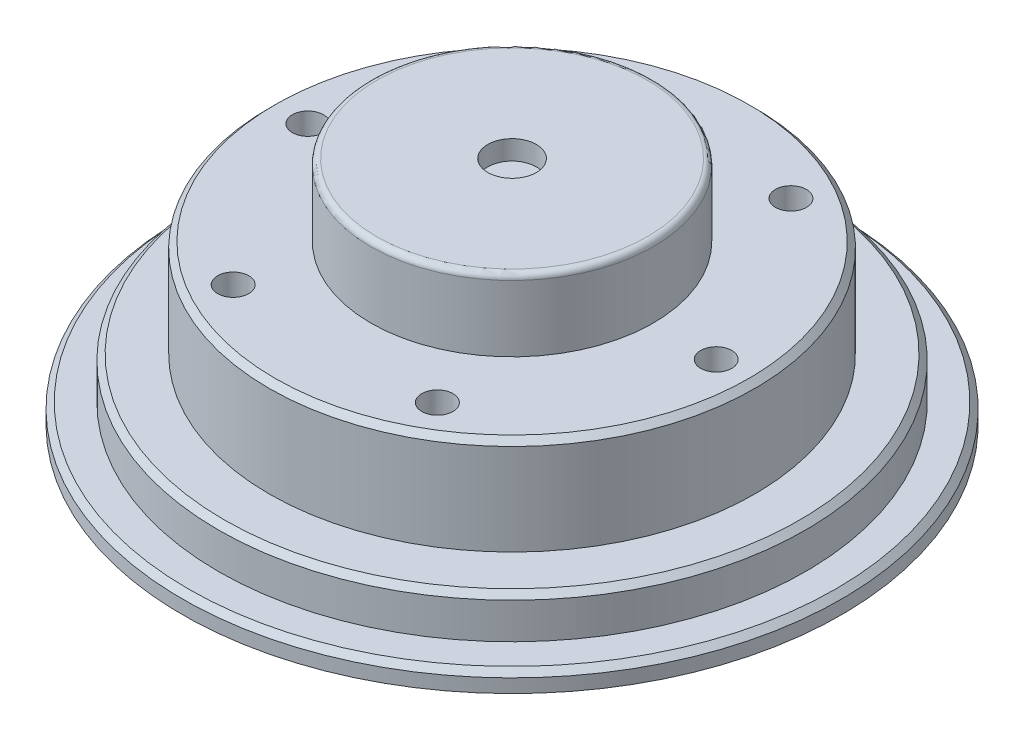
ISO-10303-21;
HEADER;
FILE_DESCRIPTION(('STEP AP214'),'2;1');
FILE_NAME('part.step','',(''),(''),'','','');
FILE_SCHEMA(('AUTOMOTIVE_DESIGN { 1 0 10303 214 1 1 1 1 }'));
ENDSEC;
DATA;
#1=APPLICATION_CONTEXT('core data for automotive mechanical design processes');
#2=APPLICATION_PROTOCOL_DEFINITION('international standard','automotive_design',2000,#1);
#3=PRODUCT_CONTEXT('',#1,'mechanical');
#4=PRODUCT('Part','Part','',(#3));
#5=PRODUCT_RELATED_PRODUCT_CATEGORY('part','',(#4));
#6=PRODUCT_DEFINITION_FORMATION('','',#4);
#7=PRODUCT_DEFINITION_CONTEXT('part definition',#1,'design');
#8=PRODUCT_DEFINITION('design','',#6,#7);
#9=PRODUCT_DEFINITION_SHAPE('','',#8);
#10=(LENGTH_UNIT() NAMED_UNIT(*) SI_UNIT(.MILLI.,.METRE.));
#11=(NAMED_UNIT(*) PLANE_ANGLE_UNIT() SI_UNIT($,.RADIAN.));
#12=(NAMED_UNIT(*) SI_UNIT($,.STERADIAN.) SOLID_ANGLE_UNIT());
#13=UNCERTAINTY_MEASURE_WITH_UNIT(LENGTH_MEASURE(1.E-05),#10,'distance_accuracy_value','');
#14=(GEOMETRIC_REPRESENTATION_CONTEXT(3) GLOBAL_UNCERTAINTY_ASSIGNED_CONTEXT((#13)) GLOBAL_UNIT_ASSIGNED_CONTEXT((#10,
#11,#12)) REPRESENTATION_CONTEXT('',''));
#15=CARTESIAN_POINT('',(0.,0.,0.));
#16=DIRECTION('',(0.,0.,1.));
#17=DIRECTION('',(1.,0.,0.));
#18=AXIS2_PLACEMENT_3D('',#15,#16,#17);
#19=CARTESIAN_POINT('',(0.,2.15,0.));
#20=DIRECTION('',(0.,-1.,0.));
#21=DIRECTION('',(0.,0.,-1.));
#22=AXIS2_PLACEMENT_3D('',#19,#20,#21);
#23=CYLINDRICAL_SURFACE('',#22,15.1);
#24=CARTESIAN_POINT('',(0.,1.85000000000001,0.));
#25=DIRECTION('',(0.,1.,0.));
#26=DIRECTION('',(0.,0.,1.));
#27=AXIS2_PLACEMENT_3D('',#24,#25,#26);
#28=CIRCLE('',#27,15.1);
#29=CARTESIAN_POINT('',(0.,1.85000000000001,15.1));
#30=VERTEX_POINT('',#29);
#31=EDGE_CURVE('E143',#30,#30,#28,.F.);
#32=ORIENTED_EDGE('',*,*,#31,.T.);
#33=EDGE_LOOP('',(#32));
#34=FACE_BOUND('',#33,.T.);
#35=CARTESIAN_POINT('',(0.,0.,0.));
#36=DIRECTION('',(0.,1.,0.));
#37=DIRECTION('',(0.,0.,1.));
#38=AXIS2_PLACEMENT_3D('',#35,#36,#37);
#39=CIRCLE('',#38,15.1);
#40=CARTESIAN_POINT('',(0.,0.,15.1));
#41=VERTEX_POINT('',#40);
#42=EDGE_CURVE('E119',#41,#41,#39,.T.);
#43=ORIENTED_EDGE('',*,*,#42,.T.);
#44=EDGE_LOOP('',(#43));
#45=FACE_BOUND('',#44,.T.);
#46=ADVANCED_FACE('F38',(#34,#45),#23,.T.);
#47=CARTESIAN_POINT('',(0.,2.15,0.));
#48=DIRECTION('',(0.,1.,0.));
#49=DIRECTION('',(0.,0.,1.));
#50=AXIS2_PLACEMENT_3D('',#47,#48,#49);
#51=PLANE('',#50);
#52=CARTESIAN_POINT('',(0.,2.15,0.));
#53=DIRECTION('',(0.,1.,0.));
#54=DIRECTION('',(0.,0.,1.));
#55=AXIS2_PLACEMENT_3D('',#52,#53,#54);
#56=CIRCLE('',#55,14.8);
#57=CARTESIAN_POINT('',(0.,2.15,14.8));
#58=VERTEX_POINT('',#57);
#59=EDGE_CURVE('E140',#58,#58,#56,.T.);
#60=ORIENTED_EDGE('',*,*,#59,.T.);
#61=EDGE_LOOP('',(#60));
#62=FACE_BOUND('',#61,.T.);
#63=CARTESIAN_POINT('',(0.,2.15,0.));
#64=DIRECTION('',(0.,1.,0.));
#65=DIRECTION('',(0.,0.,1.));
#66=AXIS2_PLACEMENT_3D('',#63,#64,#65);
#67=CIRCLE('',#66,12.49);
#68=CARTESIAN_POINT('',(0.,2.15,12.49));
#69=VERTEX_POINT('',#68);
#70=EDGE_CURVE('E124',#69,#69,#67,.T.);
#71=ORIENTED_EDGE('',*,*,#70,.F.);
#72=EDGE_LOOP('',(#71));
#73=FACE_BOUND('',#72,.T.);
#74=ADVANCED_FACE('F165',(#62,#73),#51,.T.);
#75=CARTESIAN_POINT('',(0.,7.15,0.));
#76=DIRECTION('',(0.,-1.,0.));
#77=DIRECTION('',(0.,0.,-1.));
#78=AXIS2_PLACEMENT_3D('',#75,#76,#77);
#79=CYLINDRICAL_SURFACE('',#78,12.49);
#80=CARTESIAN_POINT('',(0.,6.85000000000001,0.));
#81=DIRECTION('',(0.,1.,0.));
#82=DIRECTION('',(0.,0.,1.));
#83=AXIS2_PLACEMENT_3D('',#80,#81,#82);
#84=CIRCLE('',#83,12.49);
#85=CARTESIAN_POINT('',(0.,6.85000000000001,12.49));
#86=VERTEX_POINT('',#85);
#87=EDGE_CURVE('E11',#86,#86,#84,.F.);
#88=ORIENTED_EDGE('',*,*,#87,.T.);
#89=EDGE_LOOP('',(#88));
#90=FACE_BOUND('',#89,.T.);
#91=ORIENTED_EDGE('',*,*,#70,.T.);
#92=EDGE_LOOP('',(#91));
#93=FACE_BOUND('',#92,.T.);
#94=ADVANCED_FACE('F171',(#90,#93),#79,.T.);
#95=CARTESIAN_POINT('',(0.,7.15,0.));
#96=DIRECTION('',(0.,1.,0.));
#97=DIRECTION('',(0.,0.,1.));
#98=AXIS2_PLACEMENT_3D('',#95,#96,#97);
#99=PLANE('',#98);
#100=CARTESIAN_POINT('',(5.25,7.15,-9.09326673973661));
#101=DIRECTION('',(0.,1.,0.));
#102=DIRECTION('',(0.,0.,1.));
#103=AXIS2_PLACEMENT_3D('',#100,#101,#102);
#104=CIRCLE('',#103,0.79999999999999);
#105=CARTESIAN_POINT('',(5.25,7.15,-8.29326673973662));
#106=VERTEX_POINT('',#105);
#107=EDGE_CURVE('E76',#106,#106,#104,.T.);
#108=ORIENTED_EDGE('',*,*,#107,.F.);
#109=EDGE_LOOP('',(#108));
#110=FACE_BOUND('',#109,.T.);
#111=CARTESIAN_POINT('',(10.5,7.15,0.));
#112=DIRECTION('',(0.,1.,0.));
#113=DIRECTION('',(0.,0.,1.));
#114=AXIS2_PLACEMENT_3D('',#111,#112,#113);
#115=CIRCLE('',#114,0.79999999999999);
#116=CARTESIAN_POINT('',(10.5,7.15,0.79999999999999));
#117=VERTEX_POINT('',#116);
#118=EDGE_CURVE('E75',#117,#117,#115,.T.);
#119=ORIENTED_EDGE('',*,*,#118,.F.);
#120=EDGE_LOOP('',(#119));
#121=FACE_BOUND('',#120,.T.);
#122=CARTESIAN_POINT('',(5.25,7.15,9.09326673973661));
#123=DIRECTION('',(0.,1.,0.));
#124=DIRECTION('',(0.,0.,1.));
#125=AXIS2_PLACEMENT_3D('',#122,#123,#124);
#126=CIRCLE('',#125,0.79999999999999);
#127=CARTESIAN_POINT('',(5.25,7.15,9.8932667397366));
#128=VERTEX_POINT('',#127);
#129=EDGE_CURVE('E86',#128,#128,#126,.T.);
#130=ORIENTED_EDGE('',*,*,#129,.F.);
#131=EDGE_LOOP('',(#130));
#132=FACE_BOUND('',#131,.T.);
#133=CARTESIAN_POINT('',(-5.25,7.15,9.09326673973661));
#134=DIRECTION('',(0.,1.,0.));
#135=DIRECTION('',(0.,0.,1.));
#136=AXIS2_PLACEMENT_3D('',#133,#134,#135);
#137=CIRCLE('',#136,0.79999999999999);
#138=CARTESIAN_POINT('',(-5.25,7.15,9.8932667397366));
#139=VERTEX_POINT('',#138);
#140=EDGE_CURVE('E92',#139,#139,#137,.T.);
#141=ORIENTED_EDGE('',*,*,#140,.F.);
#142=EDGE_LOOP('',(#141));
#143=FACE_BOUND('',#142,.T.);
#144=CARTESIAN_POINT('',(-10.5,7.15,0.));
#145=DIRECTION('',(0.,1.,0.));
#146=DIRECTION('',(0.,0.,1.));
#147=AXIS2_PLACEMENT_3D('',#144,#145,#146);
#148=CIRCLE('',#147,0.79999999999999);
#149=CARTESIAN_POINT('',(-10.5,7.15,0.799999999999988));
#150=VERTEX_POINT('',#149);
#151=EDGE_CURVE('E98',#150,#150,#148,.T.);
#152=ORIENTED_EDGE('',*,*,#151,.F.);
#153=EDGE_LOOP('',(#152));
#154=FACE_BOUND('',#153,.T.);
#155=CARTESIAN_POINT('',(-5.25,7.15,-9.09326673973661));
#156=DIRECTION('',(0.,1.,0.));
#157=DIRECTION('',(0.,0.,1.));
#158=AXIS2_PLACEMENT_3D('',#155,#156,#157);
#159=CIRCLE('',#158,0.79999999999999);
#160=CARTESIAN_POINT('',(-5.25,7.15,-8.29326673973662));
#161=VERTEX_POINT('',#160);
#162=EDGE_CURVE('E104',#161,#161,#159,.T.);
#163=ORIENTED_EDGE('',*,*,#162,.F.);
#164=EDGE_LOOP('',(#163));
#165=FACE_BOUND('',#164,.T.);
#166=CARTESIAN_POINT('',(0.,7.15,0.));
#167=DIRECTION('',(0.,1.,0.));
#168=DIRECTION('',(0.,0.,1.));
#169=AXIS2_PLACEMENT_3D('',#166,#167,#168);
#170=CIRCLE('',#169,12.19);
#171=CARTESIAN_POINT('',(0.,7.15,12.19));
#172=VERTEX_POINT('',#171);
#173=EDGE_CURVE('E46',#172,#172,#170,.T.);
#174=ORIENTED_EDGE('',*,*,#173,.T.);
#175=EDGE_LOOP('',(#174));
#176=FACE_BOUND('',#175,.T.);
#177=CARTESIAN_POINT('',(0.,7.15,0.));
#178=DIRECTION('',(0.,1.,0.));
#179=DIRECTION('',(0.,0.,1.));
#180=AXIS2_PLACEMENT_3D('',#177,#178,#179);
#181=CIRCLE('',#180,7.265);
#182=CARTESIAN_POINT('',(0.,7.15,7.265));
#183=VERTEX_POINT('',#182);
#184=EDGE_CURVE('E120',#183,#183,#181,.T.);
#185=ORIENTED_EDGE('',*,*,#184,.F.);
#186=EDGE_LOOP('',(#185));
#187=FACE_BOUND('',#186,.T.);
#188=ADVANCED_FACE('F148',(#110,#121,#132,#143,#154,#165,#176,#187),#99,.T.);
#189=CARTESIAN_POINT('',(0.,10.85,0.));
#190=DIRECTION('',(0.,-1.,0.));
#191=DIRECTION('',(0.,0.,-1.));
#192=AXIS2_PLACEMENT_3D('',#189,#190,#191);
#193=CYLINDRICAL_SURFACE('',#192,7.265);
#194=CARTESIAN_POINT('',(0.,10.55,0.));
#195=DIRECTION('',(0.,1.,0.));
#196=DIRECTION('',(0.,0.,1.));
#197=AXIS2_PLACEMENT_3D('',#194,#195,#196);
#198=CIRCLE('',#197,7.265);
#199=CARTESIAN_POINT('',(0.,10.55,7.265));
#200=VERTEX_POINT('',#199);
#201=EDGE_CURVE('E131',#200,#200,#198,.F.);
#202=ORIENTED_EDGE('',*,*,#201,.T.);
#203=EDGE_LOOP('',(#202));
#204=FACE_BOUND('',#203,.T.);
#205=ORIENTED_EDGE('',*,*,#184,.T.);
#206=EDGE_LOOP('',(#205));
#207=FACE_BOUND('',#206,.T.);
#208=ADVANCED_FACE('F212',(#204,#207),#193,.T.);
#209=CARTESIAN_POINT('',(0.,10.85,0.));
#210=DIRECTION('',(0.,1.,0.));
#211=DIRECTION('',(0.,0.,1.));
#212=AXIS2_PLACEMENT_3D('',#209,#210,#211);
#213=PLANE('',#212);
#214=CARTESIAN_POINT('',(0.,10.85,0.));
#215=DIRECTION('',(0.,1.,0.));
#216=DIRECTION('',(0.,0.,1.));
#217=AXIS2_PLACEMENT_3D('',#214,#215,#216);
#218=CIRCLE('',#217,6.965);
#219=CARTESIAN_POINT('',(0.,10.85,6.965));
#220=VERTEX_POINT('',#219);
#221=EDGE_CURVE('E123',#220,#220,#218,.T.);
#222=ORIENTED_EDGE('',*,*,#221,.T.);
#223=EDGE_LOOP('',(#222));
#224=FACE_BOUND('',#223,.T.);
#225=CARTESIAN_POINT('',(0.,10.85,0.));
#226=DIRECTION('',(0.,1.,0.));
#227=DIRECTION('',(0.,0.,1.));
#228=AXIS2_PLACEMENT_3D('',#225,#226,#227);
#229=CIRCLE('',#228,1.25);
#230=CARTESIAN_POINT('',(0.,10.85,1.25));
#231=VERTEX_POINT('',#230);
#232=EDGE_CURVE('E110',#231,#231,#229,.T.);
#233=ORIENTED_EDGE('',*,*,#232,.F.);
#234=EDGE_LOOP('',(#233));
#235=FACE_BOUND('',#234,.T.);
#236=ADVANCED_FACE('F194',(#224,#235),#213,.T.);
#237=CARTESIAN_POINT('',(0.,-1.,0.));
#238=DIRECTION('',(0.,1.,0.));
#239=DIRECTION('',(0.,0.,1.));
#240=AXIS2_PLACEMENT_3D('',#237,#238,#239);
#241=CYLINDRICAL_SURFACE('',#240,16.95);
#242=CARTESIAN_POINT('',(0.,-0.300000000000005,0.));
#243=DIRECTION('',(0.,-1.,0.));
#244=DIRECTION('',(0.,0.,-1.));
#245=AXIS2_PLACEMENT_3D('',#242,#243,#244);
#246=CIRCLE('',#245,16.95);
#247=CARTESIAN_POINT('',(0.,-0.300000000000005,-16.95));
#248=VERTEX_POINT('',#247);
#249=EDGE_CURVE('E134',#248,#248,#246,.T.);
#250=ORIENTED_EDGE('',*,*,#249,.T.);
#251=EDGE_LOOP('',(#250));
#252=FACE_BOUND('',#251,.T.);
#253=CARTESIAN_POINT('',(0.,-1.,0.));
#254=DIRECTION('',(0.,-1.,0.));
#255=DIRECTION('',(0.,0.,-1.));
#256=AXIS2_PLACEMENT_3D('',#253,#254,#255);
#257=CIRCLE('',#256,16.95);
#258=CARTESIAN_POINT('',(0.,-1.,-16.95));
#259=VERTEX_POINT('',#258);
#260=EDGE_CURVE('E114',#259,#259,#257,.T.);
#261=ORIENTED_EDGE('',*,*,#260,.F.);
#262=EDGE_LOOP('',(#261));
#263=FACE_BOUND('',#262,.T.);
#264=ADVANCED_FACE('F190',(#252,#263),#241,.T.);
#265=CARTESIAN_POINT('',(0.,-1.,0.));
#266=DIRECTION('',(0.,-1.,0.));
#267=DIRECTION('',(0.,0.,-1.));
#268=AXIS2_PLACEMENT_3D('',#265,#266,#267);
#269=PLANE('',#268);
#270=ORIENTED_EDGE('',*,*,#260,.T.);
#271=EDGE_LOOP('',(#270));
#272=FACE_BOUND('',#271,.T.);
#273=ADVANCED_FACE('F193',(#272),#269,.T.);
#274=CARTESIAN_POINT('',(0.,0.,0.));
#275=DIRECTION('',(0.,-1.,0.));
#276=DIRECTION('',(0.,0.,-1.));
#277=AXIS2_PLACEMENT_3D('',#274,#275,#276);
#278=PLANE('',#277);
#279=CARTESIAN_POINT('',(0.,0.,0.));
#280=DIRECTION('',(0.,-1.,0.));
#281=DIRECTION('',(0.,0.,-1.));
#282=AXIS2_PLACEMENT_3D('',#279,#280,#281);
#283=CIRCLE('',#282,16.65);
#284=CARTESIAN_POINT('',(0.,0.,-16.65));
#285=VERTEX_POINT('',#284);
#286=EDGE_CURVE('E137',#285,#285,#283,.F.);
#287=ORIENTED_EDGE('',*,*,#286,.T.);
#288=EDGE_LOOP('',(#287));
#289=FACE_BOUND('',#288,.T.);
#290=ORIENTED_EDGE('',*,*,#42,.F.);
#291=EDGE_LOOP('',(#290));
#292=FACE_BOUND('',#291,.T.);
#293=ADVANCED_FACE('F199',(#289,#292),#278,.F.);
#294=CARTESIAN_POINT('',(0.,9.85,0.));
#295=DIRECTION('',(0.,1.,0.));
#296=DIRECTION('',(0.,0.,1.));
#297=AXIS2_PLACEMENT_3D('',#294,#295,#296);
#298=CYLINDRICAL_SURFACE('',#297,1.25);
#299=CARTESIAN_POINT('',(0.,9.85,0.));
#300=DIRECTION('',(0.,1.,0.));
#301=DIRECTION('',(0.,0.,1.));
#302=AXIS2_PLACEMENT_3D('',#299,#300,#301);
#303=CIRCLE('',#302,1.25);
#304=CARTESIAN_POINT('',(0.,9.85,1.25));
#305=VERTEX_POINT('',#304);
#306=EDGE_CURVE('E111',#305,#305,#303,.T.);
#307=ORIENTED_EDGE('',*,*,#306,.F.);
#308=EDGE_LOOP('',(#307));
#309=FACE_BOUND('',#308,.T.);
#310=ORIENTED_EDGE('',*,*,#232,.T.);
#311=EDGE_LOOP('',(#310));
#312=FACE_BOUND('',#311,.T.);
#313=ADVANCED_FACE('F204',(#309,#312),#298,.F.);
#314=CARTESIAN_POINT('',(0.,9.85,0.));
#315=DIRECTION('',(0.,1.,0.));
#316=DIRECTION('',(0.,0.,1.));
#317=AXIS2_PLACEMENT_3D('',#314,#315,#316);
#318=PLANE('',#317);
#319=ORIENTED_EDGE('',*,*,#306,.T.);
#320=EDGE_LOOP('',(#319));
#321=FACE_BOUND('',#320,.T.);
#322=ADVANCED_FACE('F180',(#321),#318,.T.);
#323=CARTESIAN_POINT('',(0.,10.55,0.));
#324=DIRECTION('',(0.,1.,0.));
#325=DIRECTION('',(0.,0.,1.));
#326=AXIS2_PLACEMENT_3D('',#323,#324,#325);
#327=TOROIDAL_SURFACE('',#326,6.965,0.3);
#328=ORIENTED_EDGE('',*,*,#201,.F.);
#329=EDGE_LOOP('',(#328));
#330=FACE_BOUND('',#329,.T.);
#331=ORIENTED_EDGE('',*,*,#221,.F.);
#332=EDGE_LOOP('',(#331));
#333=FACE_BOUND('',#332,.T.);
#334=ADVANCED_FACE('F177',(#330,#333),#327,.T.);
#335=CARTESIAN_POINT('',(0.,-0.300000000000005,0.));
#336=DIRECTION('',(0.,-1.,0.));
#337=DIRECTION('',(0.,0.,-1.));
#338=AXIS2_PLACEMENT_3D('',#335,#336,#337);
#339=CONICAL_SURFACE('',#338,16.95,0.785398163397454);
#340=ORIENTED_EDGE('',*,*,#286,.F.);
#341=EDGE_LOOP('',(#340));
#342=FACE_BOUND('',#341,.T.);
#343=ORIENTED_EDGE('',*,*,#249,.F.);
#344=EDGE_LOOP('',(#343));
#345=FACE_BOUND('',#344,.T.);
#346=ADVANCED_FACE('F161',(#342,#345),#339,.T.);
#347=CARTESIAN_POINT('',(0.,2.15,0.));
#348=DIRECTION('',(0.,-1.,0.));
#349=DIRECTION('',(0.,0.,-1.));
#350=AXIS2_PLACEMENT_3D('',#347,#348,#349);
#351=CONICAL_SURFACE('',#350,14.8,0.785398163397434);
#352=ORIENTED_EDGE('',*,*,#31,.F.);
#353=EDGE_LOOP('',(#352));
#354=FACE_BOUND('',#353,.T.);
#355=ORIENTED_EDGE('',*,*,#59,.F.);
#356=EDGE_LOOP('',(#355));
#357=FACE_BOUND('',#356,.T.);
#358=ADVANCED_FACE('F153',(#354,#357),#351,.T.);
#359=CARTESIAN_POINT('',(0.,7.15,0.));
#360=DIRECTION('',(0.,-1.,0.));
#361=DIRECTION('',(0.,0.,-1.));
#362=AXIS2_PLACEMENT_3D('',#359,#360,#361);
#363=CONICAL_SURFACE('',#362,12.19,0.785398163397451);
#364=ORIENTED_EDGE('',*,*,#87,.F.);
#365=EDGE_LOOP('',(#364));
#366=FACE_BOUND('',#365,.T.);
#367=ORIENTED_EDGE('',*,*,#173,.F.);
#368=EDGE_LOOP('',(#367));
#369=FACE_BOUND('',#368,.T.);
#370=ADVANCED_FACE('F40',(#366,#369),#363,.T.);
#371=CARTESIAN_POINT('',(-5.25,1.95,-9.09326673973661));
#372=DIRECTION('',(0.,1.,0.));
#373=DIRECTION('',(0.,0.,1.));
#374=AXIS2_PLACEMENT_3D('',#371,#372,#373);
#375=CONICAL_SURFACE('',#374,0.799999999999988,1.02974425867664);
#376=CARTESIAN_POINT('',(-5.25,1.46931150477795,-9.09326673973661));
#377=VERTEX_POINT('',#376);
#378=VERTEX_LOOP('',#377);
#379=FACE_BOUND('',#378,.T.);
#380=CARTESIAN_POINT('',(-5.25,1.95,-9.09326673973661));
#381=DIRECTION('',(0.,1.,0.));
#382=DIRECTION('',(0.,0.,1.));
#383=AXIS2_PLACEMENT_3D('',#380,#381,#382);
#384=CIRCLE('',#383,0.799999999999988);
#385=CARTESIAN_POINT('',(-5.25,1.95,-8.29326673973662));
#386=VERTEX_POINT('',#385);
#387=EDGE_CURVE('E107',#386,#386,#384,.T.);
#388=ORIENTED_EDGE('',*,*,#387,.T.);
#389=EDGE_LOOP('',(#388));
#390=FACE_BOUND('',#389,.T.);
#391=ADVANCED_FACE('F152',(#379,#390),#375,.F.);
#392=CARTESIAN_POINT('',(-5.25,7.15,-9.09326673973661));
#393=DIRECTION('',(0.,1.,0.));
#394=DIRECTION('',(0.,0.,1.));
#395=AXIS2_PLACEMENT_3D('',#392,#393,#394);
#396=CYLINDRICAL_SURFACE('',#395,0.799999999999989);
#397=ORIENTED_EDGE('',*,*,#387,.F.);
#398=EDGE_LOOP('',(#397));
#399=FACE_BOUND('',#398,.T.);
#400=ORIENTED_EDGE('',*,*,#162,.T.);
#401=EDGE_LOOP('',(#400));
#402=FACE_BOUND('',#401,.T.);
#403=ADVANCED_FACE('F159',(#399,#402),#396,.F.);
#404=CARTESIAN_POINT('',(-10.5,1.95,0.));
#405=DIRECTION('',(0.,1.,0.));
#406=DIRECTION('',(0.,0.,1.));
#407=AXIS2_PLACEMENT_3D('',#404,#405,#406);
#408=CONICAL_SURFACE('',#407,0.799999999999988,1.02974425867664);
#409=CARTESIAN_POINT('',(-10.5,1.46931150477795,0.));
#410=VERTEX_POINT('',#409);
#411=VERTEX_LOOP('',#410);
#412=FACE_BOUND('',#411,.T.);
#413=CARTESIAN_POINT('',(-10.5,1.95,0.));
#414=DIRECTION('',(0.,1.,0.));
#415=DIRECTION('',(0.,0.,1.));
#416=AXIS2_PLACEMENT_3D('',#413,#414,#415);
#417=CIRCLE('',#416,0.799999999999988);
#418=CARTESIAN_POINT('',(-10.5,1.95,0.799999999999986));
#419=VERTEX_POINT('',#418);
#420=EDGE_CURVE('E101',#419,#419,#417,.T.);
#421=ORIENTED_EDGE('',*,*,#420,.T.);
#422=EDGE_LOOP('',(#421));
#423=FACE_BOUND('',#422,.T.);
#424=ADVANCED_FACE('F285',(#412,#423),#408,.F.);
#425=CARTESIAN_POINT('',(-10.5,7.15,0.));
#426=DIRECTION('',(0.,1.,0.));
#427=DIRECTION('',(0.,0.,1.));
#428=AXIS2_PLACEMENT_3D('',#425,#426,#427);
#429=CYLINDRICAL_SURFACE('',#428,0.799999999999989);
#430=ORIENTED_EDGE('',*,*,#420,.F.);
#431=EDGE_LOOP('',(#430));
#432=FACE_BOUND('',#431,.T.);
#433=ORIENTED_EDGE('',*,*,#151,.T.);
#434=EDGE_LOOP('',(#433));
#435=FACE_BOUND('',#434,.T.);
#436=ADVANCED_FACE('F295',(#432,#435),#429,.F.);
#437=CARTESIAN_POINT('',(-5.25,1.95,9.09326673973661));
#438=DIRECTION('',(0.,1.,0.));
#439=DIRECTION('',(0.,0.,1.));
#440=AXIS2_PLACEMENT_3D('',#437,#438,#439);
#441=CONICAL_SURFACE('',#440,0.799999999999988,1.02974425867664);
#442=CARTESIAN_POINT('',(-5.25,1.46931150477795,9.09326673973661));
#443=VERTEX_POINT('',#442);
#444=VERTEX_LOOP('',#443);
#445=FACE_BOUND('',#444,.T.);
#446=CARTESIAN_POINT('',(-5.25,1.95,9.09326673973661));
#447=DIRECTION('',(0.,1.,0.));
#448=DIRECTION('',(0.,0.,1.));
#449=AXIS2_PLACEMENT_3D('',#446,#447,#448);
#450=CIRCLE('',#449,0.799999999999988);
#451=CARTESIAN_POINT('',(-5.25,1.95,9.8932667397366));
#452=VERTEX_POINT('',#451);
#453=EDGE_CURVE('E95',#452,#452,#450,.T.);
#454=ORIENTED_EDGE('',*,*,#453,.T.);
#455=EDGE_LOOP('',(#454));
#456=FACE_BOUND('',#455,.T.);
#457=ADVANCED_FACE('F303',(#445,#456),#441,.F.);
#458=CARTESIAN_POINT('',(-5.25,7.15,9.09326673973661));
#459=DIRECTION('',(0.,1.,0.));
#460=DIRECTION('',(0.,0.,1.));
#461=AXIS2_PLACEMENT_3D('',#458,#459,#460);
#462=CYLINDRICAL_SURFACE('',#461,0.799999999999989);
#463=ORIENTED_EDGE('',*,*,#453,.F.);
#464=EDGE_LOOP('',(#463));
#465=FACE_BOUND('',#464,.T.);
#466=ORIENTED_EDGE('',*,*,#140,.T.);
#467=EDGE_LOOP('',(#466));
#468=FACE_BOUND('',#467,.T.);
#469=ADVANCED_FACE('F313',(#465,#468),#462,.F.);
#470=CARTESIAN_POINT('',(5.25,1.95,9.09326673973661));
#471=DIRECTION('',(0.,1.,0.));
#472=DIRECTION('',(0.,0.,1.));
#473=AXIS2_PLACEMENT_3D('',#470,#471,#472);
#474=CONICAL_SURFACE('',#473,0.799999999999988,1.02974425867664);
#475=CARTESIAN_POINT('',(5.25,1.46931150477795,9.09326673973661));
#476=VERTEX_POINT('',#475);
#477=VERTEX_LOOP('',#476);
#478=FACE_BOUND('',#477,.T.);
#479=CARTESIAN_POINT('',(5.25,1.95,9.09326673973661));
#480=DIRECTION('',(0.,1.,0.));
#481=DIRECTION('',(0.,0.,1.));
#482=AXIS2_PLACEMENT_3D('',#479,#480,#481);
#483=CIRCLE('',#482,0.799999999999988);
#484=CARTESIAN_POINT('',(5.25,1.95,9.8932667397366));
#485=VERTEX_POINT('',#484);
#486=EDGE_CURVE('E89',#485,#485,#483,.T.);
#487=ORIENTED_EDGE('',*,*,#486,.T.);
#488=EDGE_LOOP('',(#487));
#489=FACE_BOUND('',#488,.T.);
#490=ADVANCED_FACE('F322',(#478,#489),#474,.F.);
#491=CARTESIAN_POINT('',(5.25,7.15,9.09326673973661));
#492=DIRECTION('',(0.,1.,0.));
#493=DIRECTION('',(0.,0.,1.));
#494=AXIS2_PLACEMENT_3D('',#491,#492,#493);
#495=CYLINDRICAL_SURFACE('',#494,0.799999999999989);
#496=ORIENTED_EDGE('',*,*,#486,.F.);
#497=EDGE_LOOP('',(#496));
#498=FACE_BOUND('',#497,.T.);
#499=ORIENTED_EDGE('',*,*,#129,.T.);
#500=EDGE_LOOP('',(#499));
#501=FACE_BOUND('',#500,.T.);
#502=ADVANCED_FACE('F332',(#498,#501),#495,.F.);
#503=CARTESIAN_POINT('',(10.5,1.95,0.));
#504=DIRECTION('',(0.,1.,0.));
#505=DIRECTION('',(0.,0.,1.));
#506=AXIS2_PLACEMENT_3D('',#503,#504,#505);
#507=CONICAL_SURFACE('',#506,0.799999999999988,1.02974425867664);
#508=CARTESIAN_POINT('',(10.5,1.46931150477795,0.));
#509=VERTEX_POINT('',#508);
#510=VERTEX_LOOP('',#509);
#511=FACE_BOUND('',#510,.T.);
#512=CARTESIAN_POINT('',(10.5,1.95,0.));
#513=DIRECTION('',(0.,1.,0.));
#514=DIRECTION('',(0.,0.,1.));
#515=AXIS2_PLACEMENT_3D('',#512,#513,#514);
#516=CIRCLE('',#515,0.799999999999988);
#517=CARTESIAN_POINT('',(10.5,1.95,0.799999999999988));
#518=VERTEX_POINT('',#517);
#519=EDGE_CURVE('E79',#518,#518,#516,.T.);
#520=ORIENTED_EDGE('',*,*,#519,.T.);
#521=EDGE_LOOP('',(#520));
#522=FACE_BOUND('',#521,.T.);
#523=ADVANCED_FACE('F341',(#511,#522),#507,.F.);
#524=CARTESIAN_POINT('',(10.5,7.15,0.));
#525=DIRECTION('',(0.,1.,0.));
#526=DIRECTION('',(0.,0.,1.));
#527=AXIS2_PLACEMENT_3D('',#524,#525,#526);
#528=CYLINDRICAL_SURFACE('',#527,0.799999999999989);
#529=ORIENTED_EDGE('',*,*,#519,.F.);
#530=EDGE_LOOP('',(#529));
#531=FACE_BOUND('',#530,.T.);
#532=ORIENTED_EDGE('',*,*,#118,.T.);
#533=EDGE_LOOP('',(#532));
#534=FACE_BOUND('',#533,.T.);
#535=ADVANCED_FACE('F69',(#531,#534),#528,.F.);
#536=CARTESIAN_POINT('',(5.25,1.95,-9.09326673973661));
#537=DIRECTION('',(0.,1.,0.));
#538=DIRECTION('',(0.,0.,1.));
#539=AXIS2_PLACEMENT_3D('',#536,#537,#538);
#540=CONICAL_SURFACE('',#539,0.799999999999988,1.02974425867664);
#541=CARTESIAN_POINT('',(5.25,1.46931150477795,-9.09326673973661));
#542=VERTEX_POINT('',#541);
#543=VERTEX_LOOP('',#542);
#544=FACE_BOUND('',#543,.T.);
#545=CARTESIAN_POINT('',(5.25,1.95,-9.09326673973661));
#546=DIRECTION('',(0.,1.,0.));
#547=DIRECTION('',(0.,0.,1.));
#548=AXIS2_PLACEMENT_3D('',#545,#546,#547);
#549=CIRCLE('',#548,0.799999999999988);
#550=CARTESIAN_POINT('',(5.25,1.95,-8.29326673973662));
#551=VERTEX_POINT('',#550);
#552=EDGE_CURVE('E73',#551,#551,#549,.T.);
#553=ORIENTED_EDGE('',*,*,#552,.T.);
#554=EDGE_LOOP('',(#553));
#555=FACE_BOUND('',#554,.T.);
#556=ADVANCED_FACE('F65',(#544,#555),#540,.F.);
#557=CARTESIAN_POINT('',(5.25,7.15,-9.09326673973661));
#558=DIRECTION('',(0.,1.,0.));
#559=DIRECTION('',(0.,0.,1.));
#560=AXIS2_PLACEMENT_3D('',#557,#558,#559);
#561=CYLINDRICAL_SURFACE('',#560,0.799999999999989);
#562=ORIENTED_EDGE('',*,*,#552,.F.);
#563=EDGE_LOOP('',(#562));
#564=FACE_BOUND('',#563,.T.);
#565=ORIENTED_EDGE('',*,*,#107,.T.);
#566=EDGE_LOOP('',(#565));
#567=FACE_BOUND('',#566,.T.);
#568=ADVANCED_FACE('F68',(#564,#567),#561,.F.);
#569=CLOSED_SHELL('',(#46,#74,#94,#188,#208,#236,#264,#273,#293,#313,#322,#334,#346,#358,#370,
#391,#403,#424,#436,#457,#469,#490,#502,#523,#535,#556,#568));
#570=MANIFOLD_SOLID_BREP('B2',#569);
#571=ADVANCED_BREP_SHAPE_REPRESENTATION('',(#18,#570),#14);
#572=SHAPE_DEFINITION_REPRESENTATION(#9,#571);
ENDSEC;
END-ISO-10303-21;
